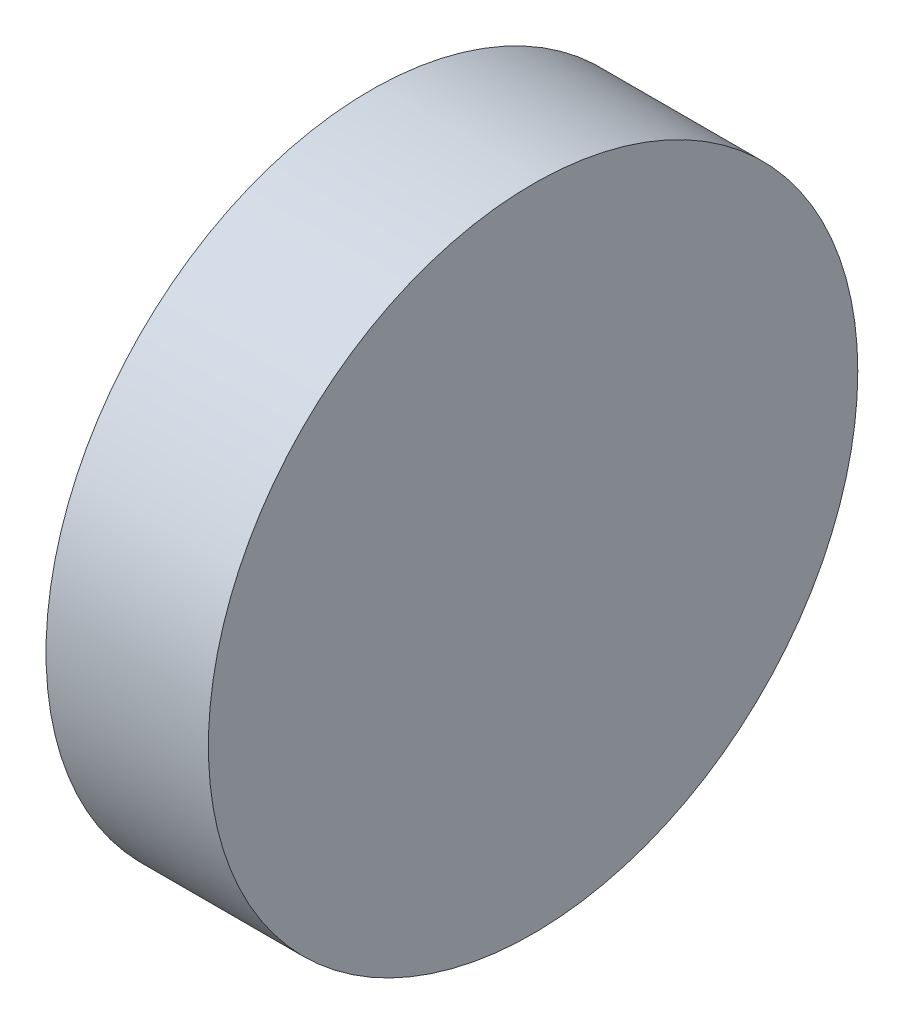
ISO-10303-21;
HEADER;
FILE_DESCRIPTION(('STEP AP214'),'2;1');
FILE_NAME('part.step','',(''),(''),'','','');
FILE_SCHEMA(('AUTOMOTIVE_DESIGN { 1 0 10303 214 1 1 1 1 }'));
ENDSEC;
DATA;
#1=APPLICATION_CONTEXT('core data for automotive mechanical design processes');
#2=APPLICATION_PROTOCOL_DEFINITION('international standard','automotive_design',2000,#1);
#3=PRODUCT_CONTEXT('',#1,'mechanical');
#4=PRODUCT('Part','Part','',(#3));
#5=PRODUCT_RELATED_PRODUCT_CATEGORY('part','',(#4));
#6=PRODUCT_DEFINITION_FORMATION('','',#4);
#7=PRODUCT_DEFINITION_CONTEXT('part definition',#1,'design');
#8=PRODUCT_DEFINITION('design','',#6,#7);
#9=PRODUCT_DEFINITION_SHAPE('','',#8);
#10=(LENGTH_UNIT() NAMED_UNIT(*) SI_UNIT(.MILLI.,.METRE.));
#11=(NAMED_UNIT(*) PLANE_ANGLE_UNIT() SI_UNIT($,.RADIAN.));
#12=(NAMED_UNIT(*) SI_UNIT($,.STERADIAN.) SOLID_ANGLE_UNIT());
#13=UNCERTAINTY_MEASURE_WITH_UNIT(LENGTH_MEASURE(1.E-05),#10,'distance_accuracy_value','');
#14=(GEOMETRIC_REPRESENTATION_CONTEXT(3) GLOBAL_UNCERTAINTY_ASSIGNED_CONTEXT((#13)) GLOBAL_UNIT_ASSIGNED_CONTEXT((#10,
#11,#12)) REPRESENTATION_CONTEXT('',''));
#15=CARTESIAN_POINT('',(0.,0.,0.));
#16=DIRECTION('',(0.,0.,1.));
#17=DIRECTION('',(1.,0.,0.));
#18=AXIS2_PLACEMENT_3D('',#15,#16,#17);
#19=CARTESIAN_POINT('',(4.7625,0.,0.));
#20=DIRECTION('',(-1.,0.,0.));
#21=DIRECTION('',(0.,0.,1.));
#22=AXIS2_PLACEMENT_3D('',#19,#20,#21);
#23=CYLINDRICAL_SURFACE('',#22,9.525);
#24=CARTESIAN_POINT('',(4.7625,0.,0.));
#25=DIRECTION('',(1.,0.,0.));
#26=DIRECTION('',(0.,0.,-1.));
#27=AXIS2_PLACEMENT_3D('',#24,#25,#26);
#28=CIRCLE('',#27,9.525);
#29=CARTESIAN_POINT('',(4.7625,0.,-9.525));
#30=VERTEX_POINT('',#29);
#31=EDGE_CURVE('E10',#30,#30,#28,.T.);
#32=ORIENTED_EDGE('',*,*,#31,.F.);
#33=EDGE_LOOP('',(#32));
#34=FACE_BOUND('',#33,.T.);
#35=CARTESIAN_POINT('',(0.,0.,0.));
#36=DIRECTION('',(1.,0.,0.));
#37=DIRECTION('',(0.,0.,-1.));
#38=AXIS2_PLACEMENT_3D('',#35,#36,#37);
#39=CIRCLE('',#38,9.525);
#40=CARTESIAN_POINT('',(0.,0.,-9.525));
#41=VERTEX_POINT('',#40);
#42=EDGE_CURVE('E33',#41,#41,#39,.T.);
#43=ORIENTED_EDGE('',*,*,#42,.T.);
#44=EDGE_LOOP('',(#43));
#45=FACE_BOUND('',#44,.T.);
#46=ADVANCED_FACE('F30',(#34,#45),#23,.T.);
#47=CARTESIAN_POINT('',(4.7625,0.,0.));
#48=DIRECTION('',(1.,0.,0.));
#49=DIRECTION('',(0.,0.,-1.));
#50=AXIS2_PLACEMENT_3D('',#47,#48,#49);
#51=PLANE('',#50);
#52=ORIENTED_EDGE('',*,*,#31,.T.);
#53=EDGE_LOOP('',(#52));
#54=FACE_BOUND('',#53,.T.);
#55=ADVANCED_FACE('F45',(#54),#51,.T.);
#56=CARTESIAN_POINT('',(0.,0.,0.));
#57=DIRECTION('',(1.,0.,0.));
#58=DIRECTION('',(0.,0.,-1.));
#59=AXIS2_PLACEMENT_3D('',#56,#57,#58);
#60=PLANE('',#59);
#61=ORIENTED_EDGE('',*,*,#42,.F.);
#62=EDGE_LOOP('',(#61));
#63=FACE_BOUND('',#62,.T.);
#64=ADVANCED_FACE('F43',(#63),#60,.F.);
#65=CLOSED_SHELL('',(#46,#55,#64));
#66=MANIFOLD_SOLID_BREP('B2',#65);
#67=ADVANCED_BREP_SHAPE_REPRESENTATION('',(#18,#66),#14);
#68=SHAPE_DEFINITION_REPRESENTATION(#9,#67);
ENDSEC;
END-ISO-10303-21;
